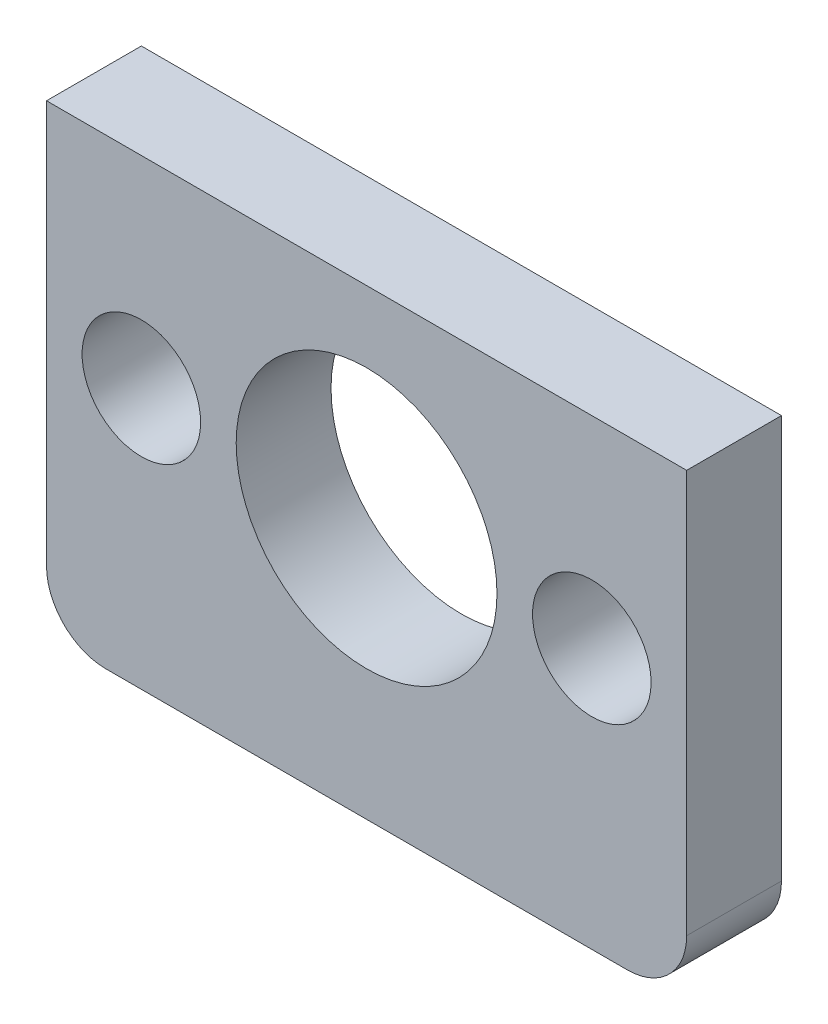
ISO-10303-21;
HEADER;
FILE_DESCRIPTION(('STEP AP214'),'2;1');
FILE_NAME('part.step','',(''),(''),'','','');
FILE_SCHEMA(('AUTOMOTIVE_DESIGN { 1 0 10303 214 1 1 1 1 }'));
ENDSEC;
DATA;
#1=APPLICATION_CONTEXT('core data for automotive mechanical design processes');
#2=APPLICATION_PROTOCOL_DEFINITION('international standard','automotive_design',2000,#1);
#3=PRODUCT_CONTEXT('',#1,'mechanical');
#4=PRODUCT('Part','Part','',(#3));
#5=PRODUCT_RELATED_PRODUCT_CATEGORY('part','',(#4));
#6=PRODUCT_DEFINITION_FORMATION('','',#4);
#7=PRODUCT_DEFINITION_CONTEXT('part definition',#1,'design');
#8=PRODUCT_DEFINITION('design','',#6,#7);
#9=PRODUCT_DEFINITION_SHAPE('','',#8);
#10=(LENGTH_UNIT() NAMED_UNIT(*) SI_UNIT(.MILLI.,.METRE.));
#11=(NAMED_UNIT(*) PLANE_ANGLE_UNIT() SI_UNIT($,.RADIAN.));
#12=(NAMED_UNIT(*) SI_UNIT($,.STERADIAN.) SOLID_ANGLE_UNIT());
#13=UNCERTAINTY_MEASURE_WITH_UNIT(LENGTH_MEASURE(1.E-05),#10,'distance_accuracy_value','');
#14=(GEOMETRIC_REPRESENTATION_CONTEXT(3) GLOBAL_UNCERTAINTY_ASSIGNED_CONTEXT((#13)) GLOBAL_UNIT_ASSIGNED_CONTEXT((#10,
#11,#12)) REPRESENTATION_CONTEXT('',''));
#15=CARTESIAN_POINT('',(0.,0.,0.));
#16=DIRECTION('',(0.,0.,1.));
#17=DIRECTION('',(1.,0.,0.));
#18=AXIS2_PLACEMENT_3D('',#15,#16,#17);
#19=CARTESIAN_POINT('',(-22.,-17.,8.));
#20=DIRECTION('',(0.,0.,-1.));
#21=DIRECTION('',(-1.,0.,0.));
#22=AXIS2_PLACEMENT_3D('',#19,#20,#21);
#23=PLANE('',#22);
#24=CARTESIAN_POINT('',(19.,0.,8.));
#25=DIRECTION('',(0.,0.,1.));
#26=DIRECTION('',(1.,0.,0.));
#27=AXIS2_PLACEMENT_3D('',#24,#25,#26);
#28=CIRCLE('',#27,5.);
#29=CARTESIAN_POINT('',(24.,0.,8.));
#30=VERTEX_POINT('',#29);
#31=EDGE_CURVE('E184',#30,#30,#28,.T.);
#32=ORIENTED_EDGE('',*,*,#31,.F.);
#33=EDGE_LOOP('',(#32));
#34=FACE_BOUND('',#33,.T.);
#35=DIRECTION('',(0.,1.,0.));
#36=VECTOR('',#35,1.);
#37=CARTESIAN_POINT('',(27.,-17.,8.));
#38=LINE('',#37,#36);
#39=CARTESIAN_POINT('',(27.,-17.,8.));
#40=VERTEX_POINT('',#39);
#41=CARTESIAN_POINT('',(27.,17.,8.));
#42=VERTEX_POINT('',#41);
#43=EDGE_CURVE('E128',#40,#42,#38,.T.);
#44=ORIENTED_EDGE('',*,*,#43,.T.);
#45=DIRECTION('',(-1.,0.,0.));
#46=VECTOR('',#45,1.);
#47=CARTESIAN_POINT('',(-27.,17.,8.));
#48=LINE('',#47,#46);
#49=CARTESIAN_POINT('',(-27.,17.,8.));
#50=VERTEX_POINT('',#49);
#51=EDGE_CURVE('E86',#42,#50,#48,.T.);
#52=ORIENTED_EDGE('',*,*,#51,.T.);
#53=DIRECTION('',(0.,-1.,0.));
#54=VECTOR('',#53,1.);
#55=CARTESIAN_POINT('',(-27.,-17.,8.));
#56=LINE('',#55,#54);
#57=CARTESIAN_POINT('',(-27.,-17.,8.));
#58=VERTEX_POINT('',#57);
#59=EDGE_CURVE('E99',#50,#58,#56,.T.);
#60=ORIENTED_EDGE('',*,*,#59,.T.);
#61=CARTESIAN_POINT('',(-22.,-17.,8.));
#62=DIRECTION('',(0.,0.,1.));
#63=DIRECTION('',(-1.,0.,0.));
#64=AXIS2_PLACEMENT_3D('',#61,#62,#63);
#65=CIRCLE('',#64,5.);
#66=CARTESIAN_POINT('',(-22.,-22.,8.));
#67=VERTEX_POINT('',#66);
#68=EDGE_CURVE('E93',#58,#67,#65,.T.);
#69=ORIENTED_EDGE('',*,*,#68,.T.);
#70=DIRECTION('',(1.,0.,0.));
#71=VECTOR('',#70,1.);
#72=CARTESIAN_POINT('',(-22.,-22.,8.));
#73=LINE('',#72,#71);
#74=CARTESIAN_POINT('',(22.,-22.,8.));
#75=VERTEX_POINT('',#74);
#76=EDGE_CURVE('E97',#67,#75,#73,.T.);
#77=ORIENTED_EDGE('',*,*,#76,.T.);
#78=CARTESIAN_POINT('',(22.,-17.,8.));
#79=DIRECTION('',(0.,0.,1.));
#80=DIRECTION('',(1.,0.,0.));
#81=AXIS2_PLACEMENT_3D('',#78,#79,#80);
#82=CIRCLE('',#81,5.);
#83=EDGE_CURVE('E49',#75,#40,#82,.T.);
#84=ORIENTED_EDGE('',*,*,#83,.T.);
#85=EDGE_LOOP('',(#44,#52,#60,#69,#77,#84));
#86=FACE_BOUND('',#85,.T.);
#87=CARTESIAN_POINT('',(-19.,0.,8.));
#88=DIRECTION('',(0.,0.,1.));
#89=DIRECTION('',(1.,0.,0.));
#90=AXIS2_PLACEMENT_3D('',#87,#88,#89);
#91=CIRCLE('',#90,5.);
#92=CARTESIAN_POINT('',(-14.,0.,8.));
#93=VERTEX_POINT('',#92);
#94=EDGE_CURVE('E121',#93,#93,#91,.T.);
#95=ORIENTED_EDGE('',*,*,#94,.F.);
#96=EDGE_LOOP('',(#95));
#97=FACE_BOUND('',#96,.T.);
#98=CARTESIAN_POINT('',(0.,0.,8.));
#99=DIRECTION('',(0.,0.,1.));
#100=DIRECTION('',(1.,0.,0.));
#101=AXIS2_PLACEMENT_3D('',#98,#99,#100);
#102=CIRCLE('',#101,11.);
#103=CARTESIAN_POINT('',(11.,0.,8.));
#104=VERTEX_POINT('',#103);
#105=EDGE_CURVE('E175',#104,#104,#102,.T.);
#106=ORIENTED_EDGE('',*,*,#105,.F.);
#107=EDGE_LOOP('',(#106));
#108=FACE_BOUND('',#107,.T.);
#109=ADVANCED_FACE('F32',(#34,#86,#97,#108),#23,.F.);
#110=CARTESIAN_POINT('',(-22.,-17.,0.));
#111=DIRECTION('',(0.,0.,-1.));
#112=DIRECTION('',(-1.,0.,0.));
#113=AXIS2_PLACEMENT_3D('',#110,#111,#112);
#114=PLANE('',#113);
#115=CARTESIAN_POINT('',(19.,0.,0.));
#116=DIRECTION('',(0.,0.,1.));
#117=DIRECTION('',(1.,0.,0.));
#118=AXIS2_PLACEMENT_3D('',#115,#116,#117);
#119=CIRCLE('',#118,5.);
#120=CARTESIAN_POINT('',(24.,0.,0.));
#121=VERTEX_POINT('',#120);
#122=EDGE_CURVE('E181',#121,#121,#119,.T.);
#123=ORIENTED_EDGE('',*,*,#122,.T.);
#124=EDGE_LOOP('',(#123));
#125=FACE_BOUND('',#124,.T.);
#126=DIRECTION('',(0.,1.,0.));
#127=VECTOR('',#126,1.);
#128=CARTESIAN_POINT('',(27.,-17.,0.));
#129=LINE('',#128,#127);
#130=CARTESIAN_POINT('',(27.,-17.,0.));
#131=VERTEX_POINT('',#130);
#132=CARTESIAN_POINT('',(27.,17.,0.));
#133=VERTEX_POINT('',#132);
#134=EDGE_CURVE('E117',#131,#133,#129,.T.);
#135=ORIENTED_EDGE('',*,*,#134,.F.);
#136=CARTESIAN_POINT('',(22.,-17.,0.));
#137=DIRECTION('',(0.,0.,1.));
#138=DIRECTION('',(1.,0.,0.));
#139=AXIS2_PLACEMENT_3D('',#136,#137,#138);
#140=CIRCLE('',#139,5.);
#141=CARTESIAN_POINT('',(22.,-22.,0.));
#142=VERTEX_POINT('',#141);
#143=EDGE_CURVE('E78',#142,#131,#140,.T.);
#144=ORIENTED_EDGE('',*,*,#143,.F.);
#145=DIRECTION('',(1.,0.,0.));
#146=VECTOR('',#145,1.);
#147=CARTESIAN_POINT('',(-22.,-22.,0.));
#148=LINE('',#147,#146);
#149=CARTESIAN_POINT('',(-22.,-22.,0.));
#150=VERTEX_POINT('',#149);
#151=EDGE_CURVE('E72',#150,#142,#148,.T.);
#152=ORIENTED_EDGE('',*,*,#151,.F.);
#153=CARTESIAN_POINT('',(-22.,-17.,0.));
#154=DIRECTION('',(0.,0.,1.));
#155=DIRECTION('',(-1.,0.,0.));
#156=AXIS2_PLACEMENT_3D('',#153,#154,#155);
#157=CIRCLE('',#156,5.);
#158=CARTESIAN_POINT('',(-27.,-17.,0.));
#159=VERTEX_POINT('',#158);
#160=EDGE_CURVE('E107',#159,#150,#157,.T.);
#161=ORIENTED_EDGE('',*,*,#160,.F.);
#162=DIRECTION('',(0.,-1.,0.));
#163=VECTOR('',#162,1.);
#164=CARTESIAN_POINT('',(-27.,-17.,0.));
#165=LINE('',#164,#163);
#166=CARTESIAN_POINT('',(-27.,17.,0.));
#167=VERTEX_POINT('',#166);
#168=EDGE_CURVE('E123',#167,#159,#165,.T.);
#169=ORIENTED_EDGE('',*,*,#168,.F.);
#170=DIRECTION('',(-1.,0.,0.));
#171=VECTOR('',#170,1.);
#172=CARTESIAN_POINT('',(-27.,17.,0.));
#173=LINE('',#172,#171);
#174=EDGE_CURVE('E120',#133,#167,#173,.T.);
#175=ORIENTED_EDGE('',*,*,#174,.F.);
#176=EDGE_LOOP('',(#135,#144,#152,#161,#169,#175));
#177=FACE_BOUND('',#176,.T.);
#178=CARTESIAN_POINT('',(-19.,0.,0.));
#179=DIRECTION('',(0.,0.,1.));
#180=DIRECTION('',(1.,0.,0.));
#181=AXIS2_PLACEMENT_3D('',#178,#179,#180);
#182=CIRCLE('',#181,5.);
#183=CARTESIAN_POINT('',(-14.,0.,0.));
#184=VERTEX_POINT('',#183);
#185=EDGE_CURVE('E187',#184,#184,#182,.T.);
#186=ORIENTED_EDGE('',*,*,#185,.T.);
#187=EDGE_LOOP('',(#186));
#188=FACE_BOUND('',#187,.T.);
#189=CARTESIAN_POINT('',(0.,0.,0.));
#190=DIRECTION('',(0.,0.,1.));
#191=DIRECTION('',(1.,0.,0.));
#192=AXIS2_PLACEMENT_3D('',#189,#190,#191);
#193=CIRCLE('',#192,11.);
#194=CARTESIAN_POINT('',(11.,0.,0.));
#195=VERTEX_POINT('',#194);
#196=EDGE_CURVE('E178',#195,#195,#193,.T.);
#197=ORIENTED_EDGE('',*,*,#196,.T.);
#198=EDGE_LOOP('',(#197));
#199=FACE_BOUND('',#198,.T.);
#200=ADVANCED_FACE('F137',(#125,#177,#188,#199),#114,.T.);
#201=CARTESIAN_POINT('',(27.,-17.,8.));
#202=DIRECTION('',(-1.,0.,0.));
#203=DIRECTION('',(0.,0.,1.));
#204=AXIS2_PLACEMENT_3D('',#201,#202,#203);
#205=PLANE('',#204);
#206=ORIENTED_EDGE('',*,*,#134,.T.);
#207=DIRECTION('',(0.,0.,-1.));
#208=VECTOR('',#207,1.);
#209=CARTESIAN_POINT('',(27.,17.,8.));
#210=LINE('',#209,#208);
#211=EDGE_CURVE('E11',#42,#133,#210,.T.);
#212=ORIENTED_EDGE('',*,*,#211,.F.);
#213=ORIENTED_EDGE('',*,*,#43,.F.);
#214=DIRECTION('',(0.,0.,-1.));
#215=VECTOR('',#214,1.);
#216=CARTESIAN_POINT('',(27.,-17.,8.));
#217=LINE('',#216,#215);
#218=EDGE_CURVE('E113',#40,#131,#217,.T.);
#219=ORIENTED_EDGE('',*,*,#218,.T.);
#220=EDGE_LOOP('',(#206,#212,#213,#219));
#221=FACE_BOUND('',#220,.T.);
#222=ADVANCED_FACE('F34',(#221),#205,.F.);
#223=CARTESIAN_POINT('',(-27.,17.,8.));
#224=DIRECTION('',(0.,-1.,0.));
#225=DIRECTION('',(0.,0.,-1.));
#226=AXIS2_PLACEMENT_3D('',#223,#224,#225);
#227=PLANE('',#226);
#228=ORIENTED_EDGE('',*,*,#174,.T.);
#229=DIRECTION('',(0.,0.,-1.));
#230=VECTOR('',#229,1.);
#231=CARTESIAN_POINT('',(-27.,17.,8.));
#232=LINE('',#231,#230);
#233=EDGE_CURVE('E41',#50,#167,#232,.T.);
#234=ORIENTED_EDGE('',*,*,#233,.F.);
#235=ORIENTED_EDGE('',*,*,#51,.F.);
#236=ORIENTED_EDGE('',*,*,#211,.T.);
#237=EDGE_LOOP('',(#228,#234,#235,#236));
#238=FACE_BOUND('',#237,.T.);
#239=ADVANCED_FACE('F236',(#238),#227,.F.);
#240=CARTESIAN_POINT('',(-27.,-17.,8.));
#241=DIRECTION('',(1.,0.,0.));
#242=DIRECTION('',(0.,0.,-1.));
#243=AXIS2_PLACEMENT_3D('',#240,#241,#242);
#244=PLANE('',#243);
#245=ORIENTED_EDGE('',*,*,#168,.T.);
#246=DIRECTION('',(0.,0.,-1.));
#247=VECTOR('',#246,1.);
#248=CARTESIAN_POINT('',(-27.,-17.,8.));
#249=LINE('',#248,#247);
#250=EDGE_CURVE('E108',#58,#159,#249,.T.);
#251=ORIENTED_EDGE('',*,*,#250,.F.);
#252=ORIENTED_EDGE('',*,*,#59,.F.);
#253=ORIENTED_EDGE('',*,*,#233,.T.);
#254=EDGE_LOOP('',(#245,#251,#252,#253));
#255=FACE_BOUND('',#254,.T.);
#256=ADVANCED_FACE('F134',(#255),#244,.F.);
#257=CARTESIAN_POINT('',(-22.,-17.,8.));
#258=DIRECTION('',(0.,0.,-1.));
#259=DIRECTION('',(-1.,0.,0.));
#260=AXIS2_PLACEMENT_3D('',#257,#258,#259);
#261=CYLINDRICAL_SURFACE('',#260,5.);
#262=ORIENTED_EDGE('',*,*,#160,.T.);
#263=DIRECTION('',(0.,0.,-1.));
#264=VECTOR('',#263,1.);
#265=CARTESIAN_POINT('',(-22.,-22.,8.));
#266=LINE('',#265,#264);
#267=EDGE_CURVE('E104',#67,#150,#266,.T.);
#268=ORIENTED_EDGE('',*,*,#267,.F.);
#269=ORIENTED_EDGE('',*,*,#68,.F.);
#270=ORIENTED_EDGE('',*,*,#250,.T.);
#271=EDGE_LOOP('',(#262,#268,#269,#270));
#272=FACE_BOUND('',#271,.T.);
#273=ADVANCED_FACE('F105',(#272),#261,.T.);
#274=CARTESIAN_POINT('',(-22.,-22.,8.));
#275=DIRECTION('',(0.,1.,0.));
#276=DIRECTION('',(0.,0.,1.));
#277=AXIS2_PLACEMENT_3D('',#274,#275,#276);
#278=PLANE('',#277);
#279=ORIENTED_EDGE('',*,*,#151,.T.);
#280=DIRECTION('',(0.,0.,-1.));
#281=VECTOR('',#280,1.);
#282=CARTESIAN_POINT('',(22.,-22.,8.));
#283=LINE('',#282,#281);
#284=EDGE_CURVE('E109',#75,#142,#283,.T.);
#285=ORIENTED_EDGE('',*,*,#284,.F.);
#286=ORIENTED_EDGE('',*,*,#76,.F.);
#287=ORIENTED_EDGE('',*,*,#267,.T.);
#288=EDGE_LOOP('',(#279,#285,#286,#287));
#289=FACE_BOUND('',#288,.T.);
#290=ADVANCED_FACE('F111',(#289),#278,.F.);
#291=CARTESIAN_POINT('',(22.,-17.,8.));
#292=DIRECTION('',(0.,0.,-1.));
#293=DIRECTION('',(-1.,0.,0.));
#294=AXIS2_PLACEMENT_3D('',#291,#292,#293);
#295=CYLINDRICAL_SURFACE('',#294,5.);
#296=ORIENTED_EDGE('',*,*,#143,.T.);
#297=ORIENTED_EDGE('',*,*,#218,.F.);
#298=ORIENTED_EDGE('',*,*,#83,.F.);
#299=ORIENTED_EDGE('',*,*,#284,.T.);
#300=EDGE_LOOP('',(#296,#297,#298,#299));
#301=FACE_BOUND('',#300,.T.);
#302=ADVANCED_FACE('F142',(#301),#295,.T.);
#303=CARTESIAN_POINT('',(-19.,0.,8.));
#304=DIRECTION('',(0.,0.,-1.));
#305=DIRECTION('',(-1.,0.,0.));
#306=AXIS2_PLACEMENT_3D('',#303,#304,#305);
#307=CYLINDRICAL_SURFACE('',#306,5.);
#308=ORIENTED_EDGE('',*,*,#94,.T.);
#309=EDGE_LOOP('',(#308));
#310=FACE_BOUND('',#309,.T.);
#311=ORIENTED_EDGE('',*,*,#185,.F.);
#312=EDGE_LOOP('',(#311));
#313=FACE_BOUND('',#312,.T.);
#314=ADVANCED_FACE('F144',(#310,#313),#307,.F.);
#315=CARTESIAN_POINT('',(19.,0.,8.));
#316=DIRECTION('',(0.,0.,-1.));
#317=DIRECTION('',(-1.,0.,0.));
#318=AXIS2_PLACEMENT_3D('',#315,#316,#317);
#319=CYLINDRICAL_SURFACE('',#318,5.);
#320=ORIENTED_EDGE('',*,*,#31,.T.);
#321=EDGE_LOOP('',(#320));
#322=FACE_BOUND('',#321,.T.);
#323=ORIENTED_EDGE('',*,*,#122,.F.);
#324=EDGE_LOOP('',(#323));
#325=FACE_BOUND('',#324,.T.);
#326=ADVANCED_FACE('F150',(#322,#325),#319,.F.);
#327=CARTESIAN_POINT('',(0.,0.,8.));
#328=DIRECTION('',(0.,0.,-1.));
#329=DIRECTION('',(-1.,0.,0.));
#330=AXIS2_PLACEMENT_3D('',#327,#328,#329);
#331=CYLINDRICAL_SURFACE('',#330,11.);
#332=ORIENTED_EDGE('',*,*,#105,.T.);
#333=EDGE_LOOP('',(#332));
#334=FACE_BOUND('',#333,.T.);
#335=ORIENTED_EDGE('',*,*,#196,.F.);
#336=EDGE_LOOP('',(#335));
#337=FACE_BOUND('',#336,.T.);
#338=ADVANCED_FACE('F166',(#334,#337),#331,.F.);
#339=CLOSED_SHELL('',(#109,#200,#222,#239,#256,#273,#290,#302,#314,#326,#338));
#340=MANIFOLD_SOLID_BREP('B2',#339);
#341=ADVANCED_BREP_SHAPE_REPRESENTATION('',(#18,#340),#14);
#342=SHAPE_DEFINITION_REPRESENTATION(#9,#341);
ENDSEC;
END-ISO-10303-21;
